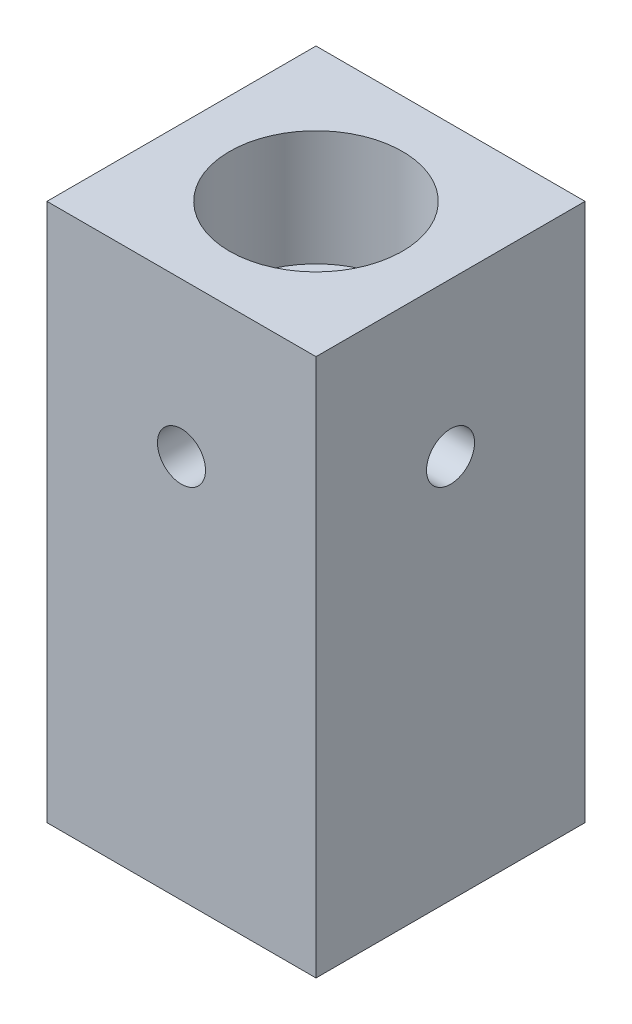
ISO-10303-21;
HEADER;
FILE_DESCRIPTION(('STEP AP214'),'2;1');
FILE_NAME('part.step','',(''),(''),'','','');
FILE_SCHEMA(('AUTOMOTIVE_DESIGN { 1 0 10303 214 1 1 1 1 }'));
ENDSEC;
DATA;
#1=APPLICATION_CONTEXT('core data for automotive mechanical design processes');
#2=APPLICATION_PROTOCOL_DEFINITION('international standard','automotive_design',2000,#1);
#3=PRODUCT_CONTEXT('',#1,'mechanical');
#4=PRODUCT('Part','Part','',(#3));
#5=PRODUCT_RELATED_PRODUCT_CATEGORY('part','',(#4));
#6=PRODUCT_DEFINITION_FORMATION('','',#4);
#7=PRODUCT_DEFINITION_CONTEXT('part definition',#1,'design');
#8=PRODUCT_DEFINITION('design','',#6,#7);
#9=PRODUCT_DEFINITION_SHAPE('','',#8);
#10=(LENGTH_UNIT() NAMED_UNIT(*) SI_UNIT(.MILLI.,.METRE.));
#11=(NAMED_UNIT(*) PLANE_ANGLE_UNIT() SI_UNIT($,.RADIAN.));
#12=(NAMED_UNIT(*) SI_UNIT($,.STERADIAN.) SOLID_ANGLE_UNIT());
#13=UNCERTAINTY_MEASURE_WITH_UNIT(LENGTH_MEASURE(1.E-05),#10,'distance_accuracy_value','');
#14=(GEOMETRIC_REPRESENTATION_CONTEXT(3) GLOBAL_UNCERTAINTY_ASSIGNED_CONTEXT((#13)) GLOBAL_UNIT_ASSIGNED_CONTEXT((#10,
#11,#12)) REPRESENTATION_CONTEXT('',''));
#15=CARTESIAN_POINT('',(0.,0.,0.));
#16=DIRECTION('',(0.,0.,1.));
#17=DIRECTION('',(1.,0.,0.));
#18=AXIS2_PLACEMENT_3D('',#15,#16,#17);
#19=CARTESIAN_POINT('',(0.,-12.0208152801713,0.));
#20=DIRECTION('',(0.,1.,0.));
#21=DIRECTION('',(0.,0.,1.));
#22=AXIS2_PLACEMENT_3D('',#19,#20,#21);
#23=CYLINDRICAL_SURFACE('',#22,4.25);
#24=CARTESIAN_POINT('',(0.,29.765625,4.25));
#25=CARTESIAN_POINT('',(0.105132022198132,29.7656307490986,4.24999517092626));
#26=CARTESIAN_POINT('',(0.210413275805808,29.7740290553429,4.24605608106871));
#27=CARTESIAN_POINT('',(0.417914942453678,29.8072746844187,4.23068880465968));
#28=CARTESIAN_POINT('',(0.520128057320497,29.832158409356,4.21924404510702));
#29=CARTESIAN_POINT('',(0.718166677229962,29.8972179184017,4.19007377973006));
#30=CARTESIAN_POINT('',(0.814014314548876,29.9373370630569,4.1723715534305));
#31=CARTESIAN_POINT('',(0.997500093061051,30.0314602933576,4.13235093123223));
#32=CARTESIAN_POINT('',(1.08513960187501,30.0854620602754,4.11003330633637));
#33=CARTESIAN_POINT('',(1.25512516040282,30.2092035076144,4.0614526763038));
#34=CARTESIAN_POINT('',(1.33691861736636,30.2796430119464,4.03504055291908));
#35=CARTESIAN_POINT('',(1.48802767766903,30.4327675266002,3.98179663183739));
#36=CARTESIAN_POINT('',(1.5573350570496,30.5154605428361,3.95496457009957));
#37=CARTESIAN_POINT('',(1.68601802760091,30.6972515141011,3.90192290056591));
#38=CARTESIAN_POINT('',(1.74444944492836,30.797068129268,3.87586837402755));
#39=CARTESIAN_POINT('',(1.84345155918498,31.0064817613267,3.82977672261499));
#40=CARTESIAN_POINT('',(1.88403366857462,31.1160724747943,3.80973575541411));
#41=CARTESIAN_POINT('',(1.94376635002635,31.3356112009587,3.77959550910423));
#42=CARTESIAN_POINT('',(1.96398765346472,31.4451971487502,3.76900333272994));
#43=CARTESIAN_POINT('',(1.98573833531541,31.6666776010193,3.75759381250021));
#44=CARTESIAN_POINT('',(1.98728231156719,31.7785702341054,3.75676883480099));
#45=CARTESIAN_POINT('',(1.97242725429133,31.9893824724704,3.76458117613683));
#46=CARTESIAN_POINT('',(1.95782358744965,32.0884715519699,3.77227181309245));
#47=CARTESIAN_POINT('',(1.91415717207816,32.2825861742691,3.79461427178424));
#48=CARTESIAN_POINT('',(1.8850907019669,32.3776106643268,3.809267885196));
#49=CARTESIAN_POINT('',(1.81275476853277,32.5635419796901,3.84422407423348));
#50=CARTESIAN_POINT('',(1.76917317135047,32.6543032752636,3.86464914947404));
#51=CARTESIAN_POINT('',(1.669273224314,32.8276308696848,3.90883696555602));
#52=CARTESIAN_POINT('',(1.61294930670526,32.9101935633947,3.93260116370147));
#53=CARTESIAN_POINT('',(1.48200431035157,33.0742289175753,3.9839203396658));
#54=CARTESIAN_POINT('',(1.40605982190146,33.1546075114425,4.01160658160023));
#55=CARTESIAN_POINT('',(1.24157957097754,33.3019077024841,4.06552197050341));
#56=CARTESIAN_POINT('',(1.15303921075838,33.3688243641564,4.09175058052413));
#57=CARTESIAN_POINT('',(0.961824376056437,33.4895001501954,4.14095024715604));
#58=CARTESIAN_POINT('',(0.858758245516909,33.5427044679014,4.1637716387996));
#59=CARTESIAN_POINT('',(0.643799451764934,33.630617864947,4.20236967102524));
#60=CARTESIAN_POINT('',(0.531912991872317,33.6653398119948,4.21815121161582));
#61=CARTESIAN_POINT('',(0.311529834482422,33.7127599732256,4.23990282787187));
#62=CARTESIAN_POINT('',(0.203411928801798,33.726919241921,4.24652202222155));
#63=CARTESIAN_POINT('',(-0.0138525345159013,33.7373012120556,4.25136402368403));
#64=CARTESIAN_POINT('',(-0.12299867586778,33.7335308851179,4.24959009432385));
#65=CARTESIAN_POINT('',(-0.331643002019223,33.7090984942447,4.2382452052507));
#66=CARTESIAN_POINT('',(-0.431304612187077,33.6895599540283,4.22919299543434));
#67=CARTESIAN_POINT('',(-0.625772363172036,33.6358243183931,4.20482077443013));
#68=CARTESIAN_POINT('',(-0.720577934412599,33.6016255078232,4.18950002987629));
#69=CARTESIAN_POINT('',(-0.90596292306725,33.5185058547181,4.15342352230894));
#70=CARTESIAN_POINT('',(-0.996323892233122,33.4691660925246,4.13251563397105));
#71=CARTESIAN_POINT('',(-1.16780407423397,33.3576231578522,4.08737184433398));
#72=CARTESIAN_POINT('',(-1.24891920180537,33.2954143331037,4.06313448226088));
#73=CARTESIAN_POINT('',(-1.40713977112266,33.1535527874371,4.01123235315905));
#74=CARTESIAN_POINT('',(-1.48326617747844,33.0728474504879,3.9834535784298));
#75=CARTESIAN_POINT('',(-1.62126997876047,32.8995667184538,3.92931175893679));
#76=CARTESIAN_POINT('',(-1.68314054971385,32.8069856715837,3.90294939679101));
#77=CARTESIAN_POINT('',(-1.79268267082203,32.608645301793,3.853896440437));
#78=CARTESIAN_POINT('',(-1.83982678082531,32.5025552296481,3.83135320753991));
#79=CARTESIAN_POINT('',(-1.91510320047226,32.2825430039004,3.79429435622465));
#80=CARTESIAN_POINT('',(-1.94325657188704,32.1686296817725,3.77976984785874));
#81=CARTESIAN_POINT('',(-1.97742977032122,31.9472487891435,3.76199531744187));
#82=CARTESIAN_POINT('',(-1.98521692037761,31.8401265608495,3.75784654205115));
#83=CARTESIAN_POINT('',(-1.98338927019169,31.626087763148,3.75881261623188));
#84=CARTESIAN_POINT('',(-1.97377937293019,31.5191711442948,3.76392485578723));
#85=CARTESIAN_POINT('',(-1.93902335717924,31.316743522362,3.7819336313973));
#86=CARTESIAN_POINT('',(-1.91506345652605,31.2209698823414,3.79423423630156));
#87=CARTESIAN_POINT('',(-1.85362146908655,31.0348474551897,3.82462485997371));
#88=CARTESIAN_POINT('',(-1.81613535274751,30.9445002940094,3.84271660378023));
#89=CARTESIAN_POINT('',(-1.72588376886972,30.7652151012327,3.8841268321826));
#90=CARTESIAN_POINT('',(-1.67227050595185,30.6767670510949,3.90771220101893));
#91=CARTESIAN_POINT('',(-1.55231968556271,30.5095789843206,3.95689319877174));
#92=CARTESIAN_POINT('',(-1.48597618101958,30.4308435333862,3.98248976392729));
#93=CARTESIAN_POINT('',(-1.33459185387995,30.2771181151788,4.0358924335306));
#94=CARTESIAN_POINT('',(-1.24834203541951,30.2032998217937,4.06366206421387));
#95=CARTESIAN_POINT('',(-1.06377202114721,30.0710056567103,4.11583233283735));
#96=CARTESIAN_POINT('',(-0.965446112073247,30.0125370884085,4.14023136444074));
#97=CARTESIAN_POINT('',(-0.759652229579723,29.9132479463863,4.18287118404435));
#98=CARTESIAN_POINT('',(-0.652235116360062,29.8723360740339,4.20114371978683));
#99=CARTESIAN_POINT('',(-0.431117079051196,29.8096376084568,4.22953528644396));
#100=CARTESIAN_POINT('',(-0.317435933232883,29.7877941163838,4.23967856707281));
#101=CARTESIAN_POINT('',(-0.169045876785075,29.7725468459759,4.24677226388347));
#102=CARTESIAN_POINT('',(-0.135305117036472,29.7699539841027,4.24798023365541));
#103=CARTESIAN_POINT('',(-0.0677147344466065,29.7664921178927,4.24959488751261));
#104=CARTESIAN_POINT('',(-0.033865109437387,29.7656231481013,4.25000155554043));
#105=CARTESIAN_POINT('',(0.,29.765625,4.25));
#106=B_SPLINE_CURVE_WITH_KNOTS('',3,(#24,#25,#26,#27,#28,#29,#30,#31,#32,#33,#34,#35,#36,#37,
#38,#39,#40,#41,#42,#43,#44,#45,#46,#47,#48,#49,#50,#51,#52,#53,#54,#55,#56,#57,#58,#59,#60,#61,
#62,#63,#64,#65,#66,#67,#68,#69,#70,#71,#72,#73,#74,#75,#76,#77,#78,#79,#80,#81,#82,#83,#84,#85,
#86,#87,#88,#89,#90,#91,#92,#93,#94,#95,#96,#97,#98,#99,#100,#101,#102,#103,#104,#105),
.UNSPECIFIED.,.T.,.F.,(4,2,2,2,2,2,2,2,2,2,2,2,2,2,2,2,2,2,2,2,2,2,2,2,2,2,2,2,2,2,2,2,2,2,2,2,
2,2,2,2,4),(0.,0.315257659788813,0.631213783143548,0.946006622621304,1.26074691833583,
1.59272074511932,1.92491243346237,2.27879790441253,2.63245677857291,2.96635617277502,
3.29999458076026,3.59995683971932,3.89999632518263,4.20695633837054,4.51405073762448,
4.85452702061237,5.1951279046731,5.54788440335584,5.90039498529483,6.22637109124989,
6.55222045721853,6.85670908514624,7.16123334588,7.47508684970798,7.78907849611228,
8.13066752080903,8.47241971896418,8.82529051337784,9.1777693084304,9.49845587425801,
9.8190520755957,10.1162284300117,10.4134933884991,10.7304540896368,11.0475632245302,
11.3965419091677,11.7456863380991,12.0929924662154,12.439258677043,12.5408073868443,
12.6423581315794),.UNSPECIFIED.);
#107=CARTESIAN_POINT('',(0.,29.765625,4.25));
#108=VERTEX_POINT('',#107);
#109=EDGE_CURVE('E197',#108,#108,#106,.T.);
#110=ORIENTED_EDGE('',*,*,#109,.T.);
#111=EDGE_LOOP('',(#110));
#112=FACE_BOUND('',#111,.T.);
#113=CARTESIAN_POINT('',(1.984375,31.75,-3.75829161446727));
#114=CARTESIAN_POINT('',(1.98436891444566,31.6455742818627,-3.75829865548168));
#115=CARTESIAN_POINT('',(1.97607849109954,31.5409936788594,-3.76270829711277));
#116=CARTESIAN_POINT('',(1.94330208810366,31.334960939116,-3.77973532441036));
#117=CARTESIAN_POINT('',(1.91877772658788,31.233516814347,-3.79237216044629));
#118=CARTESIAN_POINT('',(1.85476610949,31.0371159813401,-3.82408154631474));
#119=CARTESIAN_POINT('',(1.81535051476725,30.9421307344277,-3.84312322681412));
#120=CARTESIAN_POINT('',(1.72289210587065,30.7601441144154,-3.8854496804973));
#121=CARTESIAN_POINT('',(1.66985013865376,30.673142245559,-3.90873418993889));
#122=CARTESIAN_POINT('',(1.54719163723954,30.5027082461794,-3.95896318238055));
#123=CARTESIAN_POINT('',(1.47666172893874,30.4199751596582,-3.98605029720467));
#124=CARTESIAN_POINT('',(1.32293671857873,30.2669793199247,-4.03967387773037));
#125=CARTESIAN_POINT('',(1.23973597891996,30.1967221478771,-4.06621009231968));
#126=CARTESIAN_POINT('',(1.05722889208249,30.0667725869159,-4.11755299733366));
#127=CARTESIAN_POINT('',(0.957275188780436,30.007909691091,-4.14217513574625));
#128=CARTESIAN_POINT('',(0.747521499119906,29.9081476701724,-4.18510943280898));
#129=CARTESIAN_POINT('',(0.637726990595778,29.867238625028,-4.20342507478256));
#130=CARTESIAN_POINT('',(0.418788056389924,29.8072146443908,-4.23066219218669));
#131=CARTESIAN_POINT('',(0.310043696287029,29.7868824547466,-4.24010561309094));
#132=CARTESIAN_POINT('',(0.0903064057876021,29.7646119577863,-4.25046090626503));
#133=CARTESIAN_POINT('',(-0.0206853285339397,29.7626641112685,-4.25137720305482));
#134=CARTESIAN_POINT('',(-0.232742921491092,29.7766769595038,-4.24484788860196));
#135=CARTESIAN_POINT('',(-0.333921564741326,29.7912866053181,-4.23803307368295));
#136=CARTESIAN_POINT('',(-0.532196484473478,29.8356246934258,-4.21772469993865));
#137=CARTESIAN_POINT('',(-0.62929245718569,29.8653542585642,-4.20423064509746));
#138=CARTESIAN_POINT('',(-0.818427404917133,29.9393668344105,-4.17157436108131));
#139=CARTESIAN_POINT('',(-0.91036940001531,29.9838602190423,-4.15233062266547));
#140=CARTESIAN_POINT('',(-1.0857193115317,30.0858910399365,-4.10997110657194));
#141=CARTESIAN_POINT('',(-1.16912408245863,30.1434332590382,-4.08685390995403));
#142=CARTESIAN_POINT('',(-1.33259480781969,30.2755843159,-4.03665834182924));
#143=CARTESIAN_POINT('',(-1.41177228753373,30.3512289356296,-4.00941028882538));
#144=CARTESIAN_POINT('',(-1.55676052190228,30.5146128436179,-3.95537552021872));
#145=CARTESIAN_POINT('',(-1.62256324644459,30.6023593450142,-3.92858909055145));
#146=CARTESIAN_POINT('',(-1.74209739802652,30.7928688418029,-3.87711840365234));
#147=CARTESIAN_POINT('',(-1.79506428654184,30.8961621093066,-3.85260531584421));
#148=CARTESIAN_POINT('',(-1.88247560885328,31.1116324988599,-3.81066423999436));
#149=CARTESIAN_POINT('',(-1.91693707464465,31.2238013425234,-3.7932297405893));
#150=CARTESIAN_POINT('',(-1.96379362308706,31.4449446626707,-3.76917279490813));
#151=CARTESIAN_POINT('',(-1.97764624973217,31.5535306558852,-3.76183925477462));
#152=CARTESIAN_POINT('',(-1.98725378033949,31.7716999821408,-3.75677549401985));
#153=CARTESIAN_POINT('',(-1.98301819074358,31.881282761099,-3.75904022892496));
#154=CARTESIAN_POINT('',(-1.95790587005325,32.0879561167459,-3.77216974681464));
#155=CARTESIAN_POINT('',(-1.9385484651052,32.1852885855005,-3.78224874649255));
#156=CARTESIAN_POINT('',(-1.88589530305299,32.3751860391598,-3.80877423263142));
#157=CARTESIAN_POINT('',(-1.85259565827798,32.4677496862293,-3.82522249500903));
#158=CARTESIAN_POINT('',(-1.77134848633622,32.6502818432754,-3.86353761156038));
#159=CARTESIAN_POINT('',(-1.72279776427713,32.7399352519471,-3.88561886733084));
#160=CARTESIAN_POINT('',(-1.61297940405079,32.91031293268,-3.93247493363255));
#161=CARTESIAN_POINT('',(-1.55170548178915,32.9910327620561,-3.95725107229852));
#162=CARTESIAN_POINT('',(-1.41049539366125,33.1502658299072,-4.00989536744795));
#163=CARTESIAN_POINT('',(-1.32926426239853,33.2276200976781,-4.03781085477104));
#164=CARTESIAN_POINT('',(-1.15443000834503,33.367899136933,-4.0912273890732));
#165=CARTESIAN_POINT('',(-1.06082428540536,33.4308208682321,-4.11672792668496));
#166=CARTESIAN_POINT('',(-0.861830051147232,33.5411208553766,-4.16297026216808));
#167=CARTESIAN_POINT('',(-0.756288153903944,33.5882562425452,-4.18363634822148));
#168=CARTESIAN_POINT('',(-0.53753720129397,33.6636755998718,-4.21731693156283));
#169=CARTESIAN_POINT('',(-0.424334069795336,33.6919739559262,-4.23033726703546));
#170=CARTESIAN_POINT('',(-0.203688000095123,33.7267833024256,-4.2464356496223));
#171=CARTESIAN_POINT('',(-0.0965540273873443,33.7349170923354,-4.25025348725655));
#172=CARTESIAN_POINT('',(0.117586606700214,33.7337771762672,-4.24972049134291));
#173=CARTESIAN_POINT('',(0.224593294410754,33.724508111583,-4.24537183577639));
#174=CARTESIAN_POINT('',(0.429573354700212,33.6899615384837,-4.22941987257837));
#175=CARTESIAN_POINT('',(0.527726086261625,33.6655496575187,-4.21820925500632));
#176=CARTESIAN_POINT('',(0.718434933243414,33.602481562867,-4.18994647121515));
#177=CARTESIAN_POINT('',(0.810990136943393,33.5638230359342,-4.17289335637393));
#178=CARTESIAN_POINT('',(0.992546856420823,33.471463599247,-4.1335662828469));
#179=CARTESIAN_POINT('',(1.08119693205579,33.4171600917106,-4.11109065246004));
#180=CARTESIAN_POINT('',(1.24851447586384,33.2958480513596,-4.0634090122559));
#181=CARTESIAN_POINT('',(1.3271774260867,33.2288338024378,-4.03820177621162));
#182=CARTESIAN_POINT('',(1.47949871302199,33.0771644967657,-3.98505283905726));
#183=CARTESIAN_POINT('',(1.55211864260084,32.9914795023591,-3.95706470811338));
#184=CARTESIAN_POINT('',(1.68223784246509,32.8085019516088,-3.90352929917956));
#185=CARTESIAN_POINT('',(1.7397263854657,32.7112012310354,-3.87798376097323));
#186=CARTESIAN_POINT('',(1.8384080321445,32.5057533491988,-3.83220138434047));
#187=CARTESIAN_POINT('',(1.87936963110398,32.3974770159736,-3.81204121825542));
#188=CARTESIAN_POINT('',(1.94188524835939,32.1744316644382,-3.78058750236542));
#189=CARTESIAN_POINT('',(1.96350442462426,32.0596858390865,-3.76926420079683));
#190=CARTESIAN_POINT('',(1.97804454623115,31.9116763113507,-3.76162760349586));
#191=CARTESIAN_POINT('',(1.98041568142931,31.8794044320629,-3.76037984707076));
#192=CARTESIAN_POINT('',(1.98358188845565,31.8147600044641,-3.75871074157536));
#193=CARTESIAN_POINT('',(1.9843768874239,31.7823874515687,-3.75828943070912));
#194=CARTESIAN_POINT('',(1.984375,31.75,-3.75829161446727));
#195=B_SPLINE_CURVE_WITH_KNOTS('',3,(#113,#114,#115,#116,#117,#118,#119,#120,#121,#122,#123,
#124,#125,#126,#127,#128,#129,#130,#131,#132,#133,#134,#135,#136,#137,#138,#139,#140,#141,#142,
#143,#144,#145,#146,#147,#148,#149,#150,#151,#152,#153,#154,#155,#156,#157,#158,#159,#160,#161,
#162,#163,#164,#165,#166,#167,#168,#169,#170,#171,#172,#173,#174,#175,#176,#177,#178,#179,#180,
#181,#182,#183,#184,#185,#186,#187,#188,#189,#190,#191,#192,#193,#194),.UNSPECIFIED.,.T.,.F.,(4,
2,2,2,2,2,2,2,2,2,2,2,2,2,2,2,2,2,2,2,2,2,2,2,2,2,2,2,2,2,2,2,2,2,2,2,2,2,2,2,4),(0.,
0.313141024641628,0.62702506500735,0.939417458395205,1.25179043950573,1.58647920492769,
1.92131731995546,2.27522380608169,2.62893450112669,2.96022113167587,3.2913358559563,
3.59726235038424,3.90321156703464,4.21372228891786,4.52434700797502,4.86141161660333,
5.19867800261192,5.55274377688058,5.90648311560555,6.23376710645648,6.56087911112643,
6.85878949869181,7.15678301132772,7.46848047901407,7.78033226443038,8.12553144083206,
8.47080326610506,8.82116612447127,9.17126110176147,9.49210554840491,9.81286443886532,
10.11679035751,10.4207656467524,10.7385244161417,11.056426424087,11.4021150424469,
11.7480480780936,12.0986713444599,12.448108985361,12.5452246304073,12.6423447647062),.UNSPECIFIED.);
#196=CARTESIAN_POINT('',(1.984375,31.75,-3.75829161446727));
#197=VERTEX_POINT('',#196);
#198=EDGE_CURVE('E191',#197,#197,#195,.T.);
#199=ORIENTED_EDGE('',*,*,#198,.T.);
#200=EDGE_LOOP('',(#199));
#201=FACE_BOUND('',#200,.T.);
#202=CARTESIAN_POINT('',(-3.75829161446727,31.75,-1.984375));
#203=CARTESIAN_POINT('',(-3.75829865548168,31.6455742818627,-1.98436891444565));
#204=CARTESIAN_POINT('',(-3.76270829711277,31.5409936788594,-1.97607849109954));
#205=CARTESIAN_POINT('',(-3.77973532441036,31.334960939116,-1.94330208810366));
#206=CARTESIAN_POINT('',(-3.79237216044629,31.233516814347,-1.91877772658788));
#207=CARTESIAN_POINT('',(-3.82408154631474,31.0371159813401,-1.85476610949));
#208=CARTESIAN_POINT('',(-3.84312322681412,30.9421307344277,-1.81535051476725));
#209=CARTESIAN_POINT('',(-3.88544968049731,30.7601441144154,-1.72289210587065));
#210=CARTESIAN_POINT('',(-3.90873418993889,30.673142245559,-1.66985013865376));
#211=CARTESIAN_POINT('',(-3.95896318238055,30.5027082461794,-1.54719163723953));
#212=CARTESIAN_POINT('',(-3.98605029720468,30.4199751596582,-1.47666172893873));
#213=CARTESIAN_POINT('',(-4.03967387773037,30.2669793199247,-1.32293671857872));
#214=CARTESIAN_POINT('',(-4.06621009231969,30.1967221478771,-1.23973597891996));
#215=CARTESIAN_POINT('',(-4.11755299733366,30.0667725869159,-1.05722889208249));
#216=CARTESIAN_POINT('',(-4.14217513574625,30.007909691091,-0.957275188780436));
#217=CARTESIAN_POINT('',(-4.18510943280898,29.9081476701724,-0.747521499119905));
#218=CARTESIAN_POINT('',(-4.20342507478256,29.867238625028,-0.637726990595778));
#219=CARTESIAN_POINT('',(-4.23066219218669,29.8072146443908,-0.418788056389923));
#220=CARTESIAN_POINT('',(-4.24010561309094,29.7868824547466,-0.310043696287028));
#221=CARTESIAN_POINT('',(-4.25046090626503,29.7646119577863,-0.0903064057875999));
#222=CARTESIAN_POINT('',(-4.25137720305482,29.7626641112685,0.0206853285339425));
#223=CARTESIAN_POINT('',(-4.24484788860196,29.7766769595038,0.232742921491095));
#224=CARTESIAN_POINT('',(-4.23803307368295,29.7912866053181,0.333921564741329));
#225=CARTESIAN_POINT('',(-4.21772469993865,29.8356246934258,0.53219648447348));
#226=CARTESIAN_POINT('',(-4.20423064509746,29.8653542585642,0.629292457185693));
#227=CARTESIAN_POINT('',(-4.17157436108131,29.9393668344105,0.818427404917137));
#228=CARTESIAN_POINT('',(-4.15233062266546,29.9838602190423,0.910369400015314));
#229=CARTESIAN_POINT('',(-4.10997110657194,30.0858910399365,1.0857193115317));
#230=CARTESIAN_POINT('',(-4.08685390995403,30.1434332590382,1.16912408245863));
#231=CARTESIAN_POINT('',(-4.03665834182924,30.2755843159,1.3325948078197));
#232=CARTESIAN_POINT('',(-4.00941028882538,30.3512289356296,1.41177228753374));
#233=CARTESIAN_POINT('',(-3.95537552021872,30.5146128436179,1.55676052190229));
#234=CARTESIAN_POINT('',(-3.92858909055145,30.6023593450142,1.62256324644459));
#235=CARTESIAN_POINT('',(-3.87711840365234,30.7928688418029,1.74209739802653));
#236=CARTESIAN_POINT('',(-3.85260531584421,30.8961621093066,1.79506428654185));
#237=CARTESIAN_POINT('',(-3.81066423999435,31.1116324988599,1.88247560885329));
#238=CARTESIAN_POINT('',(-3.7932297405893,31.2238013425234,1.91693707464465));
#239=CARTESIAN_POINT('',(-3.76917279490812,31.4449446626707,1.96379362308706));
#240=CARTESIAN_POINT('',(-3.76183925477462,31.5535306558852,1.97764624973218));
#241=CARTESIAN_POINT('',(-3.75677549401985,31.7716999821408,1.9872537803395));
#242=CARTESIAN_POINT('',(-3.75904022892496,31.881282761099,1.98301819074359));
#243=CARTESIAN_POINT('',(-3.77216974681463,32.0879561167459,1.95790587005325));
#244=CARTESIAN_POINT('',(-3.78224874649254,32.1852885855005,1.93854846510521));
#245=CARTESIAN_POINT('',(-3.80877423263142,32.3751860391598,1.88589530305299));
#246=CARTESIAN_POINT('',(-3.82522249500902,32.4677496862293,1.85259565827798));
#247=CARTESIAN_POINT('',(-3.86353761156038,32.6502818432754,1.77134848633622));
#248=CARTESIAN_POINT('',(-3.88561886733084,32.7399352519471,1.72279776427713));
#249=CARTESIAN_POINT('',(-3.93247493363255,32.91031293268,1.61297940405079));
#250=CARTESIAN_POINT('',(-3.95725107229852,32.9910327620561,1.55170548178915));
#251=CARTESIAN_POINT('',(-4.00989536744795,33.1502658299072,1.41049539366125));
#252=CARTESIAN_POINT('',(-4.03781085477104,33.2276200976781,1.32926426239853));
#253=CARTESIAN_POINT('',(-4.0912273890732,33.367899136933,1.15443000834503));
#254=CARTESIAN_POINT('',(-4.11672792668496,33.4308208682321,1.06082428540536));
#255=CARTESIAN_POINT('',(-4.16297026216808,33.5411208553766,0.861830051147237));
#256=CARTESIAN_POINT('',(-4.18363634822148,33.5882562425452,0.756288153903948));
#257=CARTESIAN_POINT('',(-4.21731693156283,33.6636755998718,0.537537201293971));
#258=CARTESIAN_POINT('',(-4.23033726703546,33.6919739559262,0.424334069795335));
#259=CARTESIAN_POINT('',(-4.2464356496223,33.7267833024256,0.203688000095122));
#260=CARTESIAN_POINT('',(-4.25025348725655,33.7349170923354,0.0965540273873451));
#261=CARTESIAN_POINT('',(-4.24972049134291,33.7337771762672,-0.117586606700211));
#262=CARTESIAN_POINT('',(-4.24537183577639,33.724508111583,-0.22459329441075));
#263=CARTESIAN_POINT('',(-4.22941987257837,33.6899615384837,-0.429573354700206));
#264=CARTESIAN_POINT('',(-4.21820925500633,33.6655496575187,-0.527726086261619));
#265=CARTESIAN_POINT('',(-4.18994647121515,33.602481562867,-0.718434933243408));
#266=CARTESIAN_POINT('',(-4.17289335637393,33.5638230359342,-0.810990136943389));
#267=CARTESIAN_POINT('',(-4.1335662828469,33.471463599247,-0.992546856420822));
#268=CARTESIAN_POINT('',(-4.11109065246004,33.4171600917106,-1.08119693205579));
#269=CARTESIAN_POINT('',(-4.0634090122559,33.2958480513596,-1.24851447586384));
#270=CARTESIAN_POINT('',(-4.03820177621162,33.2288338024378,-1.3271774260867));
#271=CARTESIAN_POINT('',(-3.98505283905726,33.0771644967657,-1.47949871302199));
#272=CARTESIAN_POINT('',(-3.95706470811338,32.9914795023591,-1.55211864260084));
#273=CARTESIAN_POINT('',(-3.90352929917956,32.8085019516088,-1.68223784246509));
#274=CARTESIAN_POINT('',(-3.87798376097323,32.7112012310354,-1.7397263854657));
#275=CARTESIAN_POINT('',(-3.83220138434047,32.5057533491988,-1.8384080321445));
#276=CARTESIAN_POINT('',(-3.81204121825542,32.3974770159736,-1.87936963110398));
#277=CARTESIAN_POINT('',(-3.78058750236542,32.1744316644382,-1.94188524835939));
#278=CARTESIAN_POINT('',(-3.76926420079683,32.0596858390865,-1.96350442462426));
#279=CARTESIAN_POINT('',(-3.76162760349586,31.9116763113507,-1.97804454623115));
#280=CARTESIAN_POINT('',(-3.76037984707076,31.8794044320629,-1.98041568142931));
#281=CARTESIAN_POINT('',(-3.75871074157536,31.8147600044641,-1.98358188845565));
#282=CARTESIAN_POINT('',(-3.75828943070912,31.7823874515687,-1.9843768874239));
#283=CARTESIAN_POINT('',(-3.75829161446727,31.75,-1.984375));
#284=B_SPLINE_CURVE_WITH_KNOTS('',3,(#202,#203,#204,#205,#206,#207,#208,#209,#210,#211,#212,
#213,#214,#215,#216,#217,#218,#219,#220,#221,#222,#223,#224,#225,#226,#227,#228,#229,#230,#231,
#232,#233,#234,#235,#236,#237,#238,#239,#240,#241,#242,#243,#244,#245,#246,#247,#248,#249,#250,
#251,#252,#253,#254,#255,#256,#257,#258,#259,#260,#261,#262,#263,#264,#265,#266,#267,#268,#269,
#270,#271,#272,#273,#274,#275,#276,#277,#278,#279,#280,#281,#282,#283),.UNSPECIFIED.,.T.,.F.,(4,
2,2,2,2,2,2,2,2,2,2,2,2,2,2,2,2,2,2,2,2,2,2,2,2,2,2,2,2,2,2,2,2,2,2,2,2,2,2,2,4),(0.,
0.313141024641628,0.62702506500735,0.939417458395205,1.25179043950573,1.58647920492769,
1.92131731995546,2.27522380608169,2.62893450112669,2.96022113167587,3.2913358559563,
3.59726235038424,3.90321156703464,4.21372228891786,4.52434700797503,4.86141161660334,
5.19867800261193,5.55274377688059,5.90648311560556,6.23376710645649,6.56087911112644,
6.85878949869183,7.15678301132774,7.46848047901409,7.7803322644304,8.12553144083208,
8.47080326610507,8.82116612447128,9.17126110176148,9.49210554840493,9.81286443886532,
10.11679035751,10.4207656467524,10.7385244161417,11.056426424087,11.4021150424469,
11.7480480780937,12.0986713444599,12.448108985361,12.5452246304073,12.6423447647062),.UNSPECIFIED.);
#285=CARTESIAN_POINT('',(-3.75829161446727,31.75,-1.984375));
#286=VERTEX_POINT('',#285);
#287=EDGE_CURVE('E187',#286,#286,#284,.T.);
#288=ORIENTED_EDGE('',*,*,#287,.T.);
#289=EDGE_LOOP('',(#288));
#290=FACE_BOUND('',#289,.T.);
#291=CARTESIAN_POINT('',(3.75829161446727,31.75,-1.984375));
#292=CARTESIAN_POINT('',(3.75829865548168,31.8544257181373,-1.98436891444565));
#293=CARTESIAN_POINT('',(3.76270829711277,31.9590063211406,-1.97607849109954));
#294=CARTESIAN_POINT('',(3.77973532441036,32.165039060884,-1.94330208810366));
#295=CARTESIAN_POINT('',(3.79237216044629,32.266483185653,-1.91877772658788));
#296=CARTESIAN_POINT('',(3.82408154631474,32.4628840186599,-1.85476610949));
#297=CARTESIAN_POINT('',(3.84312322681412,32.5578692655723,-1.81535051476724));
#298=CARTESIAN_POINT('',(3.88544968049731,32.7398558855846,-1.72289210587065));
#299=CARTESIAN_POINT('',(3.90873418993889,32.826857754441,-1.66985013865376));
#300=CARTESIAN_POINT('',(3.95896318238055,32.9972917538206,-1.54719163723953));
#301=CARTESIAN_POINT('',(3.98605029720467,33.0800248403418,-1.47666172893873));
#302=CARTESIAN_POINT('',(4.03967387773037,33.2330206800753,-1.32293671857872));
#303=CARTESIAN_POINT('',(4.06621009231969,33.3032778521229,-1.23973597891996));
#304=CARTESIAN_POINT('',(4.11755299733367,33.4332274130841,-1.05722889208248));
#305=CARTESIAN_POINT('',(4.14217513574625,33.4920903089089,-0.957275188780432));
#306=CARTESIAN_POINT('',(4.18510943280898,33.5918523298276,-0.747521499119901));
#307=CARTESIAN_POINT('',(4.20342507478256,33.632761374972,-0.637726990595774));
#308=CARTESIAN_POINT('',(4.23066219218669,33.6927853556092,-0.418788056389921));
#309=CARTESIAN_POINT('',(4.24010561309094,33.7131175452534,-0.310043696287026));
#310=CARTESIAN_POINT('',(4.25046090626503,33.7353880422137,-0.0903064057875996));
#311=CARTESIAN_POINT('',(4.25137720305482,33.7373358887315,0.020685328533942));
#312=CARTESIAN_POINT('',(4.24484788860196,33.7233230404962,0.232742921491094));
#313=CARTESIAN_POINT('',(4.23803307368295,33.7087133946819,0.333921564741328));
#314=CARTESIAN_POINT('',(4.21772469993865,33.6643753065742,0.53219648447348));
#315=CARTESIAN_POINT('',(4.20423064509746,33.6346457414358,0.629292457185693));
#316=CARTESIAN_POINT('',(4.17157436108131,33.5606331655895,0.818427404917136));
#317=CARTESIAN_POINT('',(4.15233062266546,33.5161397809577,0.910369400015312));
#318=CARTESIAN_POINT('',(4.10997110657194,33.4141089600635,1.0857193115317));
#319=CARTESIAN_POINT('',(4.08685390995403,33.3565667409618,1.16912408245863));
#320=CARTESIAN_POINT('',(4.03665834182924,33.2244156841,1.3325948078197));
#321=CARTESIAN_POINT('',(4.00941028882538,33.1487710643704,1.41177228753373));
#322=CARTESIAN_POINT('',(3.95537552021872,32.9853871563821,1.55676052190229));
#323=CARTESIAN_POINT('',(3.92858909055145,32.8976406549858,1.62256324644459));
#324=CARTESIAN_POINT('',(3.87711840365234,32.7071311581971,1.74209739802652));
#325=CARTESIAN_POINT('',(3.85260531584421,32.6038378906934,1.79506428654184));
#326=CARTESIAN_POINT('',(3.81066423999436,32.3883675011402,1.88247560885329));
#327=CARTESIAN_POINT('',(3.7932297405893,32.2761986574766,1.91693707464465));
#328=CARTESIAN_POINT('',(3.76917279490812,32.0550553373293,1.96379362308706));
#329=CARTESIAN_POINT('',(3.76183925477462,31.9464693441148,1.97764624973218));
#330=CARTESIAN_POINT('',(3.75677549401985,31.7283000178592,1.9872537803395));
#331=CARTESIAN_POINT('',(3.75904022892496,31.618717238901,1.98301819074359));
#332=CARTESIAN_POINT('',(3.77216974681463,31.4120438832541,1.95790587005325));
#333=CARTESIAN_POINT('',(3.78224874649254,31.3147114144995,1.93854846510521));
#334=CARTESIAN_POINT('',(3.80877423263142,31.1248139608402,1.88589530305299));
#335=CARTESIAN_POINT('',(3.82522249500902,31.0322503137707,1.85259565827799));
#336=CARTESIAN_POINT('',(3.86353761156038,30.8497181567246,1.77134848633622));
#337=CARTESIAN_POINT('',(3.88561886733084,30.7600647480529,1.72279776427713));
#338=CARTESIAN_POINT('',(3.93247493363255,30.58968706732,1.61297940405079));
#339=CARTESIAN_POINT('',(3.95725107229852,30.5089672379439,1.55170548178915));
#340=CARTESIAN_POINT('',(4.00989536744795,30.3497341700928,1.41049539366125));
#341=CARTESIAN_POINT('',(4.03781085477104,30.2723799023219,1.32926426239853));
#342=CARTESIAN_POINT('',(4.0912273890732,30.132100863067,1.15443000834503));
#343=CARTESIAN_POINT('',(4.11672792668496,30.0691791317679,1.06082428540536));
#344=CARTESIAN_POINT('',(4.16297026216808,29.9588791446234,0.861830051147233));
#345=CARTESIAN_POINT('',(4.18363634822148,29.9117437574548,0.756288153903946));
#346=CARTESIAN_POINT('',(4.21731693156283,29.8363244001282,0.537537201293971));
#347=CARTESIAN_POINT('',(4.23033726703546,29.8080260440738,0.424334069795336));
#348=CARTESIAN_POINT('',(4.2464356496223,29.7732166975745,0.203688000095124));
#349=CARTESIAN_POINT('',(4.25025348725655,29.7650829076646,0.0965540273873463));
#350=CARTESIAN_POINT('',(4.24972049134291,29.7662228237328,-0.117586606700211));
#351=CARTESIAN_POINT('',(4.24537183577639,29.775491888417,-0.224593294410751));
#352=CARTESIAN_POINT('',(4.22941987257837,29.8100384615163,-0.429573354700207));
#353=CARTESIAN_POINT('',(4.21820925500633,29.8344503424813,-0.52772608626162));
#354=CARTESIAN_POINT('',(4.18994647121515,29.897518437133,-0.718434933243409));
#355=CARTESIAN_POINT('',(4.17289335637393,29.9361769640658,-0.810990136943389));
#356=CARTESIAN_POINT('',(4.1335662828469,30.028536400753,-0.99254685642082));
#357=CARTESIAN_POINT('',(4.11109065246004,30.0828399082894,-1.08119693205579));
#358=CARTESIAN_POINT('',(4.0634090122559,30.2041519486404,-1.24851447586384));
#359=CARTESIAN_POINT('',(4.03820177621162,30.2711661975622,-1.3271774260867));
#360=CARTESIAN_POINT('',(3.98505283905726,30.4228355032343,-1.47949871302199));
#361=CARTESIAN_POINT('',(3.95706470811338,30.5085204976409,-1.55211864260084));
#362=CARTESIAN_POINT('',(3.90352929917956,30.6914980483912,-1.68223784246509));
#363=CARTESIAN_POINT('',(3.87798376097323,30.7887987689646,-1.7397263854657));
#364=CARTESIAN_POINT('',(3.83220138434047,30.9942466508012,-1.8384080321445));
#365=CARTESIAN_POINT('',(3.81204121825542,31.1025229840264,-1.87936963110398));
#366=CARTESIAN_POINT('',(3.78058750236542,31.3255683355618,-1.94188524835939));
#367=CARTESIAN_POINT('',(3.76926420079683,31.4403141609135,-1.96350442462426));
#368=CARTESIAN_POINT('',(3.76162760349586,31.5883236886493,-1.97804454623115));
#369=CARTESIAN_POINT('',(3.76037984707076,31.6205955679371,-1.98041568142931));
#370=CARTESIAN_POINT('',(3.75871074157536,31.6852399955359,-1.98358188845565));
#371=CARTESIAN_POINT('',(3.75828943070912,31.7176125484313,-1.9843768874239));
#372=CARTESIAN_POINT('',(3.75829161446727,31.75,-1.984375));
#373=B_SPLINE_CURVE_WITH_KNOTS('',3,(#291,#292,#293,#294,#295,#296,#297,#298,#299,#300,#301,
#302,#303,#304,#305,#306,#307,#308,#309,#310,#311,#312,#313,#314,#315,#316,#317,#318,#319,#320,
#321,#322,#323,#324,#325,#326,#327,#328,#329,#330,#331,#332,#333,#334,#335,#336,#337,#338,#339,
#340,#341,#342,#343,#344,#345,#346,#347,#348,#349,#350,#351,#352,#353,#354,#355,#356,#357,#358,
#359,#360,#361,#362,#363,#364,#365,#366,#367,#368,#369,#370,#371,#372),.UNSPECIFIED.,.T.,.F.,(4,
2,2,2,2,2,2,2,2,2,2,2,2,2,2,2,2,2,2,2,2,2,2,2,2,2,2,2,2,2,2,2,2,2,2,2,2,2,2,2,4),(0.,
0.313141024641628,0.62702506500735,0.939417458395213,1.25179043950573,1.5864792049277,
1.92131731995546,2.2752238060817,2.62893450112669,2.96022113167588,3.2913358559563,
3.59726235038424,3.90321156703464,4.21372228891786,4.52434700797502,4.86141161660334,
5.19867800261193,5.55274377688058,5.90648311560555,6.23376710645649,6.56087911112644,
6.85878949869181,7.15678301132773,7.46848047901408,7.78033226443039,8.12553144083207,
8.47080326610507,8.82116612447128,9.17126110176148,9.49210554840492,9.81286443886532,
10.11679035751,10.4207656467524,10.7385244161417,11.056426424087,11.4021150424469,
11.7480480780936,12.0986713444599,12.448108985361,12.5452246304073,12.6423447647062),.UNSPECIFIED.);
#374=CARTESIAN_POINT('',(3.75829161446727,31.75,-1.984375));
#375=VERTEX_POINT('',#374);
#376=EDGE_CURVE('E179',#375,#375,#373,.T.);
#377=ORIENTED_EDGE('',*,*,#376,.T.);
#378=EDGE_LOOP('',(#377));
#379=FACE_BOUND('',#378,.T.);
#380=CARTESIAN_POINT('',(0.,25.4,0.));
#381=DIRECTION('',(0.,1.,0.));
#382=DIRECTION('',(0.,0.,1.));
#383=AXIS2_PLACEMENT_3D('',#380,#381,#382);
#384=CIRCLE('',#383,4.25);
#385=CARTESIAN_POINT('',(0.,25.4,4.25));
#386=VERTEX_POINT('',#385);
#387=EDGE_CURVE('E117',#386,#386,#384,.F.);
#388=ORIENTED_EDGE('',*,*,#387,.T.);
#389=EDGE_LOOP('',(#388));
#390=FACE_BOUND('',#389,.T.);
#391=CARTESIAN_POINT('',(0.,34.925,0.));
#392=DIRECTION('',(0.,1.,0.));
#393=DIRECTION('',(0.,0.,1.));
#394=AXIS2_PLACEMENT_3D('',#391,#392,#393);
#395=CIRCLE('',#394,4.25);
#396=CARTESIAN_POINT('',(0.,34.925,4.25));
#397=VERTEX_POINT('',#396);
#398=EDGE_CURVE('E43',#397,#397,#395,.F.);
#399=ORIENTED_EDGE('',*,*,#398,.F.);
#400=EDGE_LOOP('',(#399));
#401=FACE_BOUND('',#400,.T.);
#402=ADVANCED_FACE('F39',(#112,#201,#290,#379,#390,#401),#23,.F.);
#403=CARTESIAN_POINT('',(0.,24.638,0.));
#404=DIRECTION('',(0.,-1.,0.));
#405=DIRECTION('',(0.,0.,-1.));
#406=AXIS2_PLACEMENT_3D('',#403,#404,#405);
#407=CONICAL_SURFACE('',#406,4.24999999999999,1.02974425867665);
#408=CARTESIAN_POINT('',(0.,24.638,0.));
#409=DIRECTION('',(0.,-1.,0.));
#410=DIRECTION('',(0.,0.,-1.));
#411=AXIS2_PLACEMENT_3D('',#408,#409,#410);
#412=CIRCLE('',#411,4.24999999999999);
#413=CARTESIAN_POINT('',(0.,24.638,-4.24999999999999));
#414=VERTEX_POINT('',#413);
#415=EDGE_CURVE('E109',#414,#414,#412,.T.);
#416=ORIENTED_EDGE('',*,*,#415,.T.);
#417=EDGE_LOOP('',(#416));
#418=FACE_BOUND('',#417,.T.);
#419=CARTESIAN_POINT('',(0.,25.4,0.));
#420=DIRECTION('',(0.,1.,0.));
#421=DIRECTION('',(0.,0.,1.));
#422=AXIS2_PLACEMENT_3D('',#419,#420,#421);
#423=CIRCLE('',#422,2.98181903444889);
#424=CARTESIAN_POINT('',(0.,25.4,2.98181903444889));
#425=VERTEX_POINT('',#424);
#426=EDGE_CURVE('E114',#425,#425,#423,.F.);
#427=ORIENTED_EDGE('',*,*,#426,.F.);
#428=EDGE_LOOP('',(#427));
#429=FACE_BOUND('',#428,.T.);
#430=ADVANCED_FACE('F135',(#418,#429),#407,.F.);
#431=CARTESIAN_POINT('',(-11.1125,44.45,11.1125));
#432=DIRECTION('',(1.,0.,0.));
#433=DIRECTION('',(0.,0.,-1.));
#434=AXIS2_PLACEMENT_3D('',#431,#432,#433);
#435=PLANE('',#434);
#436=CARTESIAN_POINT('',(-11.1125,31.75,0.));
#437=DIRECTION('',(1.,0.,0.));
#438=DIRECTION('',(0.,0.,-1.));
#439=AXIS2_PLACEMENT_3D('',#436,#437,#438);
#440=CIRCLE('',#439,1.984375);
#441=CARTESIAN_POINT('',(-11.1125,31.75,-1.984375));
#442=VERTEX_POINT('',#441);
#443=EDGE_CURVE('E236',#442,#442,#440,.T.);
#444=ORIENTED_EDGE('',*,*,#443,.T.);
#445=EDGE_LOOP('',(#444));
#446=FACE_BOUND('',#445,.T.);
#447=DIRECTION('',(0.,0.,1.));
#448=VECTOR('',#447,1.);
#449=CARTESIAN_POINT('',(-11.1125,0.,11.1125));
#450=LINE('',#449,#448);
#451=CARTESIAN_POINT('',(-11.1125,0.,-11.1125));
#452=VERTEX_POINT('',#451);
#453=CARTESIAN_POINT('',(-11.1125,0.,11.1125));
#454=VERTEX_POINT('',#453);
#455=EDGE_CURVE('E106',#452,#454,#450,.T.);
#456=ORIENTED_EDGE('',*,*,#455,.T.);
#457=DIRECTION('',(0.,-1.,0.));
#458=VECTOR('',#457,1.);
#459=CARTESIAN_POINT('',(-11.1125,44.45,11.1125));
#460=LINE('',#459,#458);
#461=CARTESIAN_POINT('',(-11.1125,44.45,11.1125));
#462=VERTEX_POINT('',#461);
#463=EDGE_CURVE('E12',#462,#454,#460,.T.);
#464=ORIENTED_EDGE('',*,*,#463,.F.);
#465=DIRECTION('',(0.,0.,1.));
#466=VECTOR('',#465,1.);
#467=CARTESIAN_POINT('',(-11.1125,44.45,11.1125));
#468=LINE('',#467,#466);
#469=CARTESIAN_POINT('',(-11.1125,44.45,-11.1125));
#470=VERTEX_POINT('',#469);
#471=EDGE_CURVE('E93',#470,#462,#468,.T.);
#472=ORIENTED_EDGE('',*,*,#471,.F.);
#473=DIRECTION('',(0.,-1.,0.));
#474=VECTOR('',#473,1.);
#475=CARTESIAN_POINT('',(-11.1125,44.45,-11.1125));
#476=LINE('',#475,#474);
#477=EDGE_CURVE('E102',#470,#452,#476,.T.);
#478=ORIENTED_EDGE('',*,*,#477,.T.);
#479=EDGE_LOOP('',(#456,#464,#472,#478));
#480=FACE_BOUND('',#479,.T.);
#481=ADVANCED_FACE('F41',(#446,#480),#435,.F.);
#482=CARTESIAN_POINT('',(11.1125,44.45,11.1125));
#483=DIRECTION('',(0.,0.,-1.));
#484=DIRECTION('',(-1.,0.,0.));
#485=AXIS2_PLACEMENT_3D('',#482,#483,#484);
#486=PLANE('',#485);
#487=CARTESIAN_POINT('',(0.,31.75,11.1125));
#488=DIRECTION('',(0.,0.,1.));
#489=DIRECTION('',(1.,0.,0.));
#490=AXIS2_PLACEMENT_3D('',#487,#488,#489);
#491=CIRCLE('',#490,1.984375);
#492=CARTESIAN_POINT('',(1.984375,31.75,11.1125));
#493=VERTEX_POINT('',#492);
#494=EDGE_CURVE('E199',#493,#493,#491,.T.);
#495=ORIENTED_EDGE('',*,*,#494,.F.);
#496=EDGE_LOOP('',(#495));
#497=FACE_BOUND('',#496,.T.);
#498=DIRECTION('',(1.,0.,0.));
#499=VECTOR('',#498,1.);
#500=CARTESIAN_POINT('',(11.1125,0.,11.1125));
#501=LINE('',#500,#499);
#502=CARTESIAN_POINT('',(11.1125,0.,11.1125));
#503=VERTEX_POINT('',#502);
#504=EDGE_CURVE('E97',#454,#503,#501,.T.);
#505=ORIENTED_EDGE('',*,*,#504,.T.);
#506=DIRECTION('',(0.,-1.,0.));
#507=VECTOR('',#506,1.);
#508=CARTESIAN_POINT('',(11.1125,44.45,11.1125));
#509=LINE('',#508,#507);
#510=CARTESIAN_POINT('',(11.1125,44.45,11.1125));
#511=VERTEX_POINT('',#510);
#512=EDGE_CURVE('E49',#511,#503,#509,.T.);
#513=ORIENTED_EDGE('',*,*,#512,.F.);
#514=DIRECTION('',(1.,0.,0.));
#515=VECTOR('',#514,1.);
#516=CARTESIAN_POINT('',(11.1125,44.45,11.1125));
#517=LINE('',#516,#515);
#518=EDGE_CURVE('E88',#462,#511,#517,.T.);
#519=ORIENTED_EDGE('',*,*,#518,.F.);
#520=ORIENTED_EDGE('',*,*,#463,.T.);
#521=EDGE_LOOP('',(#505,#513,#519,#520));
#522=FACE_BOUND('',#521,.T.);
#523=ADVANCED_FACE('F96',(#497,#522),#486,.F.);
#524=CARTESIAN_POINT('',(11.1125,44.45,11.1125));
#525=DIRECTION('',(-1.,0.,0.));
#526=DIRECTION('',(0.,0.,1.));
#527=AXIS2_PLACEMENT_3D('',#524,#525,#526);
#528=PLANE('',#527);
#529=CARTESIAN_POINT('',(11.1125,31.75,0.));
#530=DIRECTION('',(1.,0.,0.));
#531=DIRECTION('',(0.,0.,-1.));
#532=AXIS2_PLACEMENT_3D('',#529,#530,#531);
#533=CIRCLE('',#532,1.984375);
#534=CARTESIAN_POINT('',(11.1125,31.75,-1.984375));
#535=VERTEX_POINT('',#534);
#536=EDGE_CURVE('E240',#535,#535,#533,.T.);
#537=ORIENTED_EDGE('',*,*,#536,.F.);
#538=EDGE_LOOP('',(#537));
#539=FACE_BOUND('',#538,.T.);
#540=DIRECTION('',(0.,0.,-1.));
#541=VECTOR('',#540,1.);
#542=CARTESIAN_POINT('',(11.1125,0.,11.1125));
#543=LINE('',#542,#541);
#544=CARTESIAN_POINT('',(11.1125,0.,-11.1125));
#545=VERTEX_POINT('',#544);
#546=EDGE_CURVE('E75',#503,#545,#543,.T.);
#547=ORIENTED_EDGE('',*,*,#546,.T.);
#548=DIRECTION('',(0.,-1.,0.));
#549=VECTOR('',#548,1.);
#550=CARTESIAN_POINT('',(11.1125,44.45,-11.1125));
#551=LINE('',#550,#549);
#552=CARTESIAN_POINT('',(11.1125,44.45,-11.1125));
#553=VERTEX_POINT('',#552);
#554=EDGE_CURVE('E98',#553,#545,#551,.T.);
#555=ORIENTED_EDGE('',*,*,#554,.F.);
#556=DIRECTION('',(0.,0.,-1.));
#557=VECTOR('',#556,1.);
#558=CARTESIAN_POINT('',(11.1125,44.45,11.1125));
#559=LINE('',#558,#557);
#560=EDGE_CURVE('E91',#511,#553,#559,.T.);
#561=ORIENTED_EDGE('',*,*,#560,.F.);
#562=ORIENTED_EDGE('',*,*,#512,.T.);
#563=EDGE_LOOP('',(#547,#555,#561,#562));
#564=FACE_BOUND('',#563,.T.);
#565=ADVANCED_FACE('F100',(#539,#564),#528,.F.);
#566=CARTESIAN_POINT('',(11.1125,44.45,-11.1125));
#567=DIRECTION('',(0.,0.,1.));
#568=DIRECTION('',(1.,0.,0.));
#569=AXIS2_PLACEMENT_3D('',#566,#567,#568);
#570=PLANE('',#569);
#571=CARTESIAN_POINT('',(0.,31.75,-11.1125));
#572=DIRECTION('',(0.,0.,1.));
#573=DIRECTION('',(1.,0.,0.));
#574=AXIS2_PLACEMENT_3D('',#571,#572,#573);
#575=CIRCLE('',#574,1.984375);
#576=CARTESIAN_POINT('',(1.984375,31.75,-11.1125));
#577=VERTEX_POINT('',#576);
#578=EDGE_CURVE('E198',#577,#577,#575,.T.);
#579=ORIENTED_EDGE('',*,*,#578,.T.);
#580=EDGE_LOOP('',(#579));
#581=FACE_BOUND('',#580,.T.);
#582=DIRECTION('',(-1.,0.,0.));
#583=VECTOR('',#582,1.);
#584=CARTESIAN_POINT('',(11.1125,0.,-11.1125));
#585=LINE('',#584,#583);
#586=EDGE_CURVE('E81',#545,#452,#585,.T.);
#587=ORIENTED_EDGE('',*,*,#586,.T.);
#588=ORIENTED_EDGE('',*,*,#477,.F.);
#589=DIRECTION('',(-1.,0.,0.));
#590=VECTOR('',#589,1.);
#591=CARTESIAN_POINT('',(11.1125,44.45,-11.1125));
#592=LINE('',#591,#590);
#593=EDGE_CURVE('E58',#553,#470,#592,.T.);
#594=ORIENTED_EDGE('',*,*,#593,.F.);
#595=ORIENTED_EDGE('',*,*,#554,.T.);
#596=EDGE_LOOP('',(#587,#588,#594,#595));
#597=FACE_BOUND('',#596,.T.);
#598=ADVANCED_FACE('F151',(#581,#597),#570,.F.);
#599=CARTESIAN_POINT('',(0.,44.45,0.));
#600=DIRECTION('',(0.,1.,0.));
#601=DIRECTION('',(0.,0.,1.));
#602=AXIS2_PLACEMENT_3D('',#599,#600,#601);
#603=PLANE('',#602);
#604=CARTESIAN_POINT('',(0.,44.45,0.));
#605=DIRECTION('',(0.,1.,0.));
#606=DIRECTION('',(0.,0.,1.));
#607=AXIS2_PLACEMENT_3D('',#604,#605,#606);
#608=CIRCLE('',#607,7.14375);
#609=CARTESIAN_POINT('',(0.,44.45,7.14375));
#610=VERTEX_POINT('',#609);
#611=EDGE_CURVE('E129',#610,#610,#608,.T.);
#612=ORIENTED_EDGE('',*,*,#611,.F.);
#613=EDGE_LOOP('',(#612));
#614=FACE_BOUND('',#613,.T.);
#615=ORIENTED_EDGE('',*,*,#471,.T.);
#616=ORIENTED_EDGE('',*,*,#518,.T.);
#617=ORIENTED_EDGE('',*,*,#560,.T.);
#618=ORIENTED_EDGE('',*,*,#593,.T.);
#619=EDGE_LOOP('',(#615,#616,#617,#618));
#620=FACE_BOUND('',#619,.T.);
#621=ADVANCED_FACE('F89',(#614,#620),#603,.T.);
#622=CARTESIAN_POINT('',(0.,0.,0.));
#623=DIRECTION('',(0.,1.,0.));
#624=DIRECTION('',(0.,0.,1.));
#625=AXIS2_PLACEMENT_3D('',#622,#623,#624);
#626=PLANE('',#625);
#627=CARTESIAN_POINT('',(0.,0.,0.));
#628=DIRECTION('',(0.,-1.,0.));
#629=DIRECTION('',(0.,0.,-1.));
#630=AXIS2_PLACEMENT_3D('',#627,#628,#629);
#631=CIRCLE('',#630,4.24999999999999);
#632=CARTESIAN_POINT('',(0.,0.,-4.24999999999999));
#633=VERTEX_POINT('',#632);
#634=EDGE_CURVE('E116',#633,#633,#631,.T.);
#635=ORIENTED_EDGE('',*,*,#634,.F.);
#636=EDGE_LOOP('',(#635));
#637=FACE_BOUND('',#636,.T.);
#638=ORIENTED_EDGE('',*,*,#455,.F.);
#639=ORIENTED_EDGE('',*,*,#586,.F.);
#640=ORIENTED_EDGE('',*,*,#546,.F.);
#641=ORIENTED_EDGE('',*,*,#504,.F.);
#642=EDGE_LOOP('',(#638,#639,#640,#641));
#643=FACE_BOUND('',#642,.T.);
#644=ADVANCED_FACE('F142',(#637,#643),#626,.F.);
#645=CARTESIAN_POINT('',(0.,0.,0.));
#646=DIRECTION('',(0.,-1.,0.));
#647=DIRECTION('',(0.,0.,-1.));
#648=AXIS2_PLACEMENT_3D('',#645,#646,#647);
#649=CYLINDRICAL_SURFACE('',#648,4.24999999999999);
#650=ORIENTED_EDGE('',*,*,#415,.F.);
#651=EDGE_LOOP('',(#650));
#652=FACE_BOUND('',#651,.T.);
#653=ORIENTED_EDGE('',*,*,#634,.T.);
#654=EDGE_LOOP('',(#653));
#655=FACE_BOUND('',#654,.T.);
#656=ADVANCED_FACE('F138',(#652,#655),#649,.F.);
#657=CARTESIAN_POINT('',(0.,25.4,0.));
#658=DIRECTION('',(0.,1.,0.));
#659=DIRECTION('',(0.,0.,1.));
#660=AXIS2_PLACEMENT_3D('',#657,#658,#659);
#661=PLANE('',#660);
#662=ORIENTED_EDGE('',*,*,#387,.F.);
#663=EDGE_LOOP('',(#662));
#664=FACE_BOUND('',#663,.T.);
#665=ORIENTED_EDGE('',*,*,#426,.T.);
#666=EDGE_LOOP('',(#665));
#667=FACE_BOUND('',#666,.T.);
#668=ADVANCED_FACE('F141',(#664,#667),#661,.T.);
#669=CARTESIAN_POINT('',(0.,34.925,0.));
#670=DIRECTION('',(0.,1.,0.));
#671=DIRECTION('',(0.,0.,1.));
#672=AXIS2_PLACEMENT_3D('',#669,#670,#671);
#673=PLANE('',#672);
#674=CARTESIAN_POINT('',(0.,34.925,0.));
#675=DIRECTION('',(0.,1.,0.));
#676=DIRECTION('',(0.,0.,1.));
#677=AXIS2_PLACEMENT_3D('',#674,#675,#676);
#678=CIRCLE('',#677,7.14375);
#679=CARTESIAN_POINT('',(0.,34.925,7.14375));
#680=VERTEX_POINT('',#679);
#681=EDGE_CURVE('E127',#680,#680,#678,.T.);
#682=ORIENTED_EDGE('',*,*,#681,.T.);
#683=EDGE_LOOP('',(#682));
#684=FACE_BOUND('',#683,.T.);
#685=ORIENTED_EDGE('',*,*,#398,.T.);
#686=EDGE_LOOP('',(#685));
#687=FACE_BOUND('',#686,.T.);
#688=ADVANCED_FACE('F216',(#684,#687),#673,.T.);
#689=CARTESIAN_POINT('',(0.,34.925,0.));
#690=DIRECTION('',(0.,1.,0.));
#691=DIRECTION('',(0.,0.,1.));
#692=AXIS2_PLACEMENT_3D('',#689,#690,#691);
#693=CYLINDRICAL_SURFACE('',#692,7.14375);
#694=ORIENTED_EDGE('',*,*,#681,.F.);
#695=EDGE_LOOP('',(#694));
#696=FACE_BOUND('',#695,.T.);
#697=ORIENTED_EDGE('',*,*,#611,.T.);
#698=EDGE_LOOP('',(#697));
#699=FACE_BOUND('',#698,.T.);
#700=ADVANCED_FACE('F219',(#696,#699),#693,.F.);
#701=CARTESIAN_POINT('',(-11.1125,31.75,0.));
#702=DIRECTION('',(1.,0.,0.));
#703=DIRECTION('',(0.,0.,-1.));
#704=AXIS2_PLACEMENT_3D('',#701,#702,#703);
#705=CYLINDRICAL_SURFACE('',#704,1.984375);
#706=ORIENTED_EDGE('',*,*,#536,.T.);
#707=EDGE_LOOP('',(#706));
#708=FACE_BOUND('',#707,.T.);
#709=ORIENTED_EDGE('',*,*,#376,.F.);
#710=EDGE_LOOP('',(#709));
#711=FACE_BOUND('',#710,.T.);
#712=ADVANCED_FACE('F214',(#708,#711),#705,.F.);
#713=ORIENTED_EDGE('',*,*,#443,.F.);
#714=EDGE_LOOP('',(#713));
#715=FACE_BOUND('',#714,.T.);
#716=ORIENTED_EDGE('',*,*,#287,.F.);
#717=EDGE_LOOP('',(#716));
#718=FACE_BOUND('',#717,.T.);
#719=ADVANCED_FACE('F209',(#715,#718),#705,.F.);
#720=CARTESIAN_POINT('',(0.,31.75,-11.1125));
#721=DIRECTION('',(0.,0.,1.));
#722=DIRECTION('',(1.,0.,0.));
#723=AXIS2_PLACEMENT_3D('',#720,#721,#722);
#724=CYLINDRICAL_SURFACE('',#723,1.984375);
#725=ORIENTED_EDGE('',*,*,#578,.F.);
#726=EDGE_LOOP('',(#725));
#727=FACE_BOUND('',#726,.T.);
#728=ORIENTED_EDGE('',*,*,#198,.F.);
#729=EDGE_LOOP('',(#728));
#730=FACE_BOUND('',#729,.T.);
#731=ADVANCED_FACE('F207',(#727,#730),#724,.F.);
#732=ORIENTED_EDGE('',*,*,#494,.T.);
#733=EDGE_LOOP('',(#732));
#734=FACE_BOUND('',#733,.T.);
#735=ORIENTED_EDGE('',*,*,#109,.F.);
#736=EDGE_LOOP('',(#735));
#737=FACE_BOUND('',#736,.T.);
#738=ADVANCED_FACE('F204',(#734,#737),#724,.F.);
#739=CLOSED_SHELL('',(#402,#430,#481,#523,#565,#598,#621,#644,#656,#668,#688,#700,#712,#719,
#731,#738));
#740=MANIFOLD_SOLID_BREP('B2',#739);
#741=ADVANCED_BREP_SHAPE_REPRESENTATION('',(#18,#740),#14);
#742=SHAPE_DEFINITION_REPRESENTATION(#9,#741);
ENDSEC;
END-ISO-10303-21;
